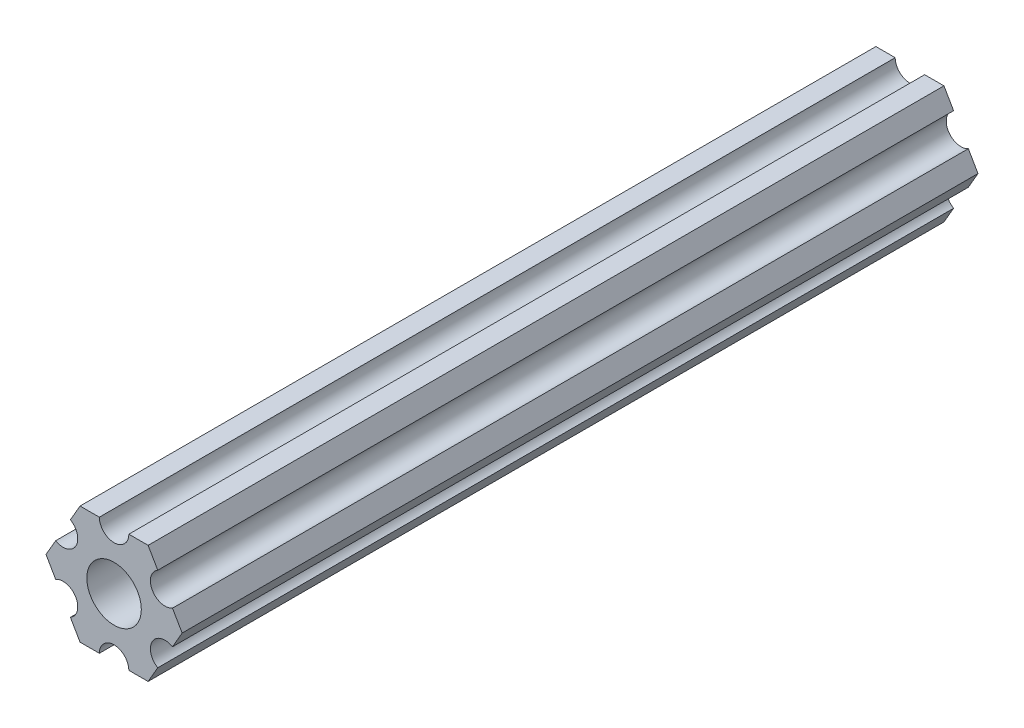
ISO-10303-21;
HEADER;
FILE_DESCRIPTION(('STEP AP214'),'2;1');
FILE_NAME('part.step','',(''),(''),'','','');
FILE_SCHEMA(('AUTOMOTIVE_DESIGN { 1 0 10303 214 1 1 1 1 }'));
ENDSEC;
DATA;
#1=APPLICATION_CONTEXT('core data for automotive mechanical design processes');
#2=APPLICATION_PROTOCOL_DEFINITION('international standard','automotive_design',2000,#1);
#3=PRODUCT_CONTEXT('',#1,'mechanical');
#4=PRODUCT('Part','Part','',(#3));
#5=PRODUCT_RELATED_PRODUCT_CATEGORY('part','',(#4));
#6=PRODUCT_DEFINITION_FORMATION('','',#4);
#7=PRODUCT_DEFINITION_CONTEXT('part definition',#1,'design');
#8=PRODUCT_DEFINITION('design','',#6,#7);
#9=PRODUCT_DEFINITION_SHAPE('','',#8);
#10=(LENGTH_UNIT() NAMED_UNIT(*) SI_UNIT(.MILLI.,.METRE.));
#11=(NAMED_UNIT(*) PLANE_ANGLE_UNIT() SI_UNIT($,.RADIAN.));
#12=(NAMED_UNIT(*) SI_UNIT($,.STERADIAN.) SOLID_ANGLE_UNIT());
#13=UNCERTAINTY_MEASURE_WITH_UNIT(LENGTH_MEASURE(1.E-05),#10,'distance_accuracy_value','');
#14=(GEOMETRIC_REPRESENTATION_CONTEXT(3) GLOBAL_UNCERTAINTY_ASSIGNED_CONTEXT((#13)) GLOBAL_UNIT_ASSIGNED_CONTEXT((#10,
#11,#12)) REPRESENTATION_CONTEXT('',''));
#15=CARTESIAN_POINT('',(0.,0.,0.));
#16=DIRECTION('',(0.,0.,1.));
#17=DIRECTION('',(1.,0.,0.));
#18=AXIS2_PLACEMENT_3D('',#15,#16,#17);
#19=CARTESIAN_POINT('',(5.49926150638083,-3.17499966684068,85.725));
#20=DIRECTION('',(0.,0.,-1.));
#21=DIRECTION('',(-1.,0.,0.));
#22=AXIS2_PLACEMENT_3D('',#19,#20,#21);
#23=CYLINDRICAL_SURFACE('',#22,1.58750000000001);
#24=CARTESIAN_POINT('',(5.49926150638083,-3.17499966684068,0.));
#25=DIRECTION('',(0.,0.,1.));
#26=DIRECTION('',(1.,0.,0.));
#27=AXIS2_PLACEMENT_3D('',#24,#25,#26);
#28=CIRCLE('',#27,1.58750000000001);
#29=CARTESIAN_POINT('',(6.29301142309098,-1.80018429024546,0.));
#30=VERTEX_POINT('',#29);
#31=CARTESIAN_POINT('',(4.70551158967068,-4.54981504343589,0.));
#32=VERTEX_POINT('',#31);
#33=EDGE_CURVE('E189',#30,#32,#28,.T.);
#34=ORIENTED_EDGE('',*,*,#33,.F.);
#35=DIRECTION('',(0.,0.,-1.));
#36=VECTOR('',#35,1.);
#37=CARTESIAN_POINT('',(6.29301142309098,-1.80018429024546,85.725));
#38=LINE('',#37,#36);
#39=CARTESIAN_POINT('',(6.29301142309098,-1.80018429024546,85.725));
#40=VERTEX_POINT('',#39);
#41=EDGE_CURVE('E11',#40,#30,#38,.T.);
#42=ORIENTED_EDGE('',*,*,#41,.F.);
#43=CARTESIAN_POINT('',(5.49926150638083,-3.17499966684068,85.725));
#44=DIRECTION('',(0.,0.,1.));
#45=DIRECTION('',(1.,0.,0.));
#46=AXIS2_PLACEMENT_3D('',#43,#44,#45);
#47=CIRCLE('',#46,1.58750000000001);
#48=CARTESIAN_POINT('',(4.70551158967068,-4.54981504343589,85.725));
#49=VERTEX_POINT('',#48);
#50=EDGE_CURVE('E240',#40,#49,#47,.T.);
#51=ORIENTED_EDGE('',*,*,#50,.T.);
#52=DIRECTION('',(0.,0.,-1.));
#53=VECTOR('',#52,1.);
#54=CARTESIAN_POINT('',(4.70551158967068,-4.54981504343589,85.725));
#55=LINE('',#54,#53);
#56=EDGE_CURVE('E35',#49,#32,#55,.T.);
#57=ORIENTED_EDGE('',*,*,#56,.T.);
#58=EDGE_LOOP('',(#34,#42,#51,#57));
#59=FACE_BOUND('',#58,.T.);
#60=ADVANCED_FACE('F32',(#59),#23,.F.);
#61=CARTESIAN_POINT('',(7.33234841870826,4.44212518961143E-07,85.725));
#62=DIRECTION('',(0.866025434075723,-0.499999947533953,0.));
#63=DIRECTION('',(0.499999947533953,0.866025434075723,0.));
#64=AXIS2_PLACEMENT_3D('',#61,#62,#63);
#65=PLANE('',#64);
#66=DIRECTION('',(-0.499999947533953,-0.866025434075723,0.));
#67=VECTOR('',#66,1.);
#68=CARTESIAN_POINT('',(7.33234841870826,4.44212518961143E-07,0.));
#69=LINE('',#68,#67);
#70=CARTESIAN_POINT('',(7.33234841870826,4.44212518961143E-07,0.));
#71=VERTEX_POINT('',#70);
#72=EDGE_CURVE('E238',#71,#30,#69,.T.);
#73=ORIENTED_EDGE('',*,*,#72,.F.);
#74=DIRECTION('',(0.,0.,-1.));
#75=VECTOR('',#74,1.);
#76=CARTESIAN_POINT('',(7.33234841870826,4.44212518961143E-07,85.725));
#77=LINE('',#76,#75);
#78=CARTESIAN_POINT('',(7.33234841870826,4.44212518961143E-07,85.725));
#79=VERTEX_POINT('',#78);
#80=EDGE_CURVE('E41',#79,#71,#77,.T.);
#81=ORIENTED_EDGE('',*,*,#80,.F.);
#82=DIRECTION('',(-0.499999947533953,-0.866025434075723,0.));
#83=VECTOR('',#82,1.);
#84=CARTESIAN_POINT('',(7.33234841870826,4.44212518961143E-07,85.725));
#85=LINE('',#84,#83);
#86=EDGE_CURVE('E179',#79,#40,#85,.T.);
#87=ORIENTED_EDGE('',*,*,#86,.T.);
#88=ORIENTED_EDGE('',*,*,#41,.T.);
#89=EDGE_LOOP('',(#73,#81,#87,#88));
#90=FACE_BOUND('',#89,.T.);
#91=ADVANCED_FACE('F272',(#90),#65,.T.);
#92=CARTESIAN_POINT('',(6.29301120497139,1.80018505273895,85.725));
#93=DIRECTION('',(0.866025373493145,0.500000052466056,0.));
#94=DIRECTION('',(-0.500000052466056,0.866025373493145,0.));
#95=AXIS2_PLACEMENT_3D('',#92,#93,#94);
#96=PLANE('',#95);
#97=DIRECTION('',(0.500000052466056,-0.866025373493145,0.));
#98=VECTOR('',#97,1.);
#99=CARTESIAN_POINT('',(6.29301120497139,1.80018505273895,0.));
#100=LINE('',#99,#98);
#101=CARTESIAN_POINT('',(6.29301120497139,1.80018505273895,0.));
#102=VERTEX_POINT('',#101);
#103=EDGE_CURVE('E166',#102,#71,#100,.T.);
#104=ORIENTED_EDGE('',*,*,#103,.F.);
#105=DIRECTION('',(0.,0.,-1.));
#106=VECTOR('',#105,1.);
#107=CARTESIAN_POINT('',(6.29301120497139,1.80018505273895,85.725));
#108=LINE('',#107,#106);
#109=CARTESIAN_POINT('',(6.29301120497139,1.80018505273895,85.725));
#110=VERTEX_POINT('',#109);
#111=EDGE_CURVE('E161',#110,#102,#108,.T.);
#112=ORIENTED_EDGE('',*,*,#111,.F.);
#113=DIRECTION('',(0.500000052466056,-0.866025373493145,0.));
#114=VECTOR('',#113,1.);
#115=CARTESIAN_POINT('',(6.29301120497139,1.80018505273895,85.725));
#116=LINE('',#115,#114);
#117=EDGE_CURVE('E164',#110,#79,#116,.T.);
#118=ORIENTED_EDGE('',*,*,#117,.T.);
#119=ORIENTED_EDGE('',*,*,#80,.T.);
#120=EDGE_LOOP('',(#104,#112,#118,#119));
#121=FACE_BOUND('',#120,.T.);
#122=ADVANCED_FACE('F163',(#121),#96,.T.);
#123=CARTESIAN_POINT('',(5.49926112168153,3.17500033315932,85.725));
#124=DIRECTION('',(0.,0.,-1.));
#125=DIRECTION('',(-1.,0.,0.));
#126=AXIS2_PLACEMENT_3D('',#123,#124,#125);
#127=CYLINDRICAL_SURFACE('',#126,1.5875);
#128=CARTESIAN_POINT('',(5.49926112168153,3.17500033315932,0.));
#129=DIRECTION('',(0.,0.,1.));
#130=DIRECTION('',(1.,0.,0.));
#131=AXIS2_PLACEMENT_3D('',#128,#129,#130);
#132=CIRCLE('',#131,1.5875);
#133=CARTESIAN_POINT('',(4.70551103839166,4.54981561357968,0.));
#134=VERTEX_POINT('',#133);
#135=EDGE_CURVE('E235',#134,#102,#132,.T.);
#136=ORIENTED_EDGE('',*,*,#135,.F.);
#137=DIRECTION('',(0.,0.,-1.));
#138=VECTOR('',#137,1.);
#139=CARTESIAN_POINT('',(4.70551103839166,4.54981561357968,85.725));
#140=LINE('',#139,#138);
#141=CARTESIAN_POINT('',(4.70551103839166,4.54981561357968,85.725));
#142=VERTEX_POINT('',#141);
#143=EDGE_CURVE('E171',#142,#134,#140,.T.);
#144=ORIENTED_EDGE('',*,*,#143,.F.);
#145=CARTESIAN_POINT('',(5.49926112168153,3.17500033315932,85.725));
#146=DIRECTION('',(0.,0.,1.));
#147=DIRECTION('',(1.,0.,0.));
#148=AXIS2_PLACEMENT_3D('',#145,#146,#147);
#149=CIRCLE('',#148,1.5875);
#150=EDGE_CURVE('E177',#142,#110,#149,.T.);
#151=ORIENTED_EDGE('',*,*,#150,.T.);
#152=ORIENTED_EDGE('',*,*,#111,.T.);
#153=EDGE_LOOP('',(#136,#144,#151,#152));
#154=FACE_BOUND('',#153,.T.);
#155=ADVANCED_FACE('F181',(#154),#127,.F.);
#156=CARTESIAN_POINT('',(3.66617382465472,6.35000022210622,85.725));
#157=DIRECTION('',(0.866025373493145,0.500000052466056,0.));
#158=DIRECTION('',(-0.500000052466056,0.866025373493145,0.));
#159=AXIS2_PLACEMENT_3D('',#156,#157,#158);
#160=PLANE('',#159);
#161=DIRECTION('',(0.500000052466056,-0.866025373493145,0.));
#162=VECTOR('',#161,1.);
#163=CARTESIAN_POINT('',(3.66617382465472,6.35000022210622,0.));
#164=LINE('',#163,#162);
#165=CARTESIAN_POINT('',(3.66617382465472,6.35000022210622,0.));
#166=VERTEX_POINT('',#165);
#167=EDGE_CURVE('E232',#166,#134,#164,.T.);
#168=ORIENTED_EDGE('',*,*,#167,.F.);
#169=DIRECTION('',(0.,0.,-1.));
#170=VECTOR('',#169,1.);
#171=CARTESIAN_POINT('',(3.66617382465472,6.35000022210622,85.725));
#172=LINE('',#171,#170);
#173=CARTESIAN_POINT('',(3.66617382465472,6.35000022210622,85.725));
#174=VERTEX_POINT('',#173);
#175=EDGE_CURVE('E244',#174,#166,#172,.T.);
#176=ORIENTED_EDGE('',*,*,#175,.F.);
#177=DIRECTION('',(0.500000052466056,-0.866025373493145,0.));
#178=VECTOR('',#177,1.);
#179=CARTESIAN_POINT('',(3.66617382465472,6.35000022210622,85.725));
#180=LINE('',#179,#178);
#181=EDGE_CURVE('E182',#174,#142,#180,.T.);
#182=ORIENTED_EDGE('',*,*,#181,.T.);
#183=ORIENTED_EDGE('',*,*,#143,.T.);
#184=EDGE_LOOP('',(#168,#176,#182,#183));
#185=FACE_BOUND('',#184,.T.);
#186=ADVANCED_FACE('F285',(#185),#160,.T.);
#187=CARTESIAN_POINT('',(1.58749961530066,6.35000022210622,85.725));
#188=DIRECTION('',(0.,1.,0.));
#189=DIRECTION('',(0.,0.,1.));
#190=AXIS2_PLACEMENT_3D('',#187,#188,#189);
#191=PLANE('',#190);
#192=DIRECTION('',(1.,0.,0.));
#193=VECTOR('',#192,1.);
#194=CARTESIAN_POINT('',(1.58749961530066,6.35000022210622,0.));
#195=LINE('',#194,#193);
#196=CARTESIAN_POINT('',(1.58749961530066,6.35000022210622,0.));
#197=VERTEX_POINT('',#196);
#198=EDGE_CURVE('E229',#197,#166,#195,.T.);
#199=ORIENTED_EDGE('',*,*,#198,.F.);
#200=DIRECTION('',(0.,0.,-1.));
#201=VECTOR('',#200,1.);
#202=CARTESIAN_POINT('',(1.58749961530066,6.35000022210622,85.725));
#203=LINE('',#202,#201);
#204=CARTESIAN_POINT('',(1.58749961530066,6.35000022210622,85.725));
#205=VERTEX_POINT('',#204);
#206=EDGE_CURVE('E246',#205,#197,#203,.T.);
#207=ORIENTED_EDGE('',*,*,#206,.F.);
#208=DIRECTION('',(1.,0.,0.));
#209=VECTOR('',#208,1.);
#210=CARTESIAN_POINT('',(1.58749961530066,6.35000022210622,85.725));
#211=LINE('',#210,#209);
#212=EDGE_CURVE('E184',#205,#174,#211,.T.);
#213=ORIENTED_EDGE('',*,*,#212,.T.);
#214=ORIENTED_EDGE('',*,*,#175,.T.);
#215=EDGE_LOOP('',(#199,#207,#213,#214));
#216=FACE_BOUND('',#215,.T.);
#217=ADVANCED_FACE('F288',(#216),#191,.T.);
#218=CARTESIAN_POINT('',(-3.84699344189937E-07,6.35000022210623,85.725));
#219=DIRECTION('',(0.,0.,-1.));
#220=DIRECTION('',(-1.,0.,0.));
#221=AXIS2_PLACEMENT_3D('',#218,#219,#220);
#222=CYLINDRICAL_SURFACE('',#221,1.5875);
#223=CARTESIAN_POINT('',(-3.84699344189937E-07,6.35000022210623,0.));
#224=DIRECTION('',(0.,0.,1.));
#225=DIRECTION('',(1.,0.,0.));
#226=AXIS2_PLACEMENT_3D('',#223,#224,#225);
#227=CIRCLE('',#226,1.5875);
#228=CARTESIAN_POINT('',(-1.58750038469935,6.35000022210622,0.));
#229=VERTEX_POINT('',#228);
#230=EDGE_CURVE('E226',#229,#197,#227,.T.);
#231=ORIENTED_EDGE('',*,*,#230,.F.);
#232=DIRECTION('',(0.,0.,-1.));
#233=VECTOR('',#232,1.);
#234=CARTESIAN_POINT('',(-1.58750038469935,6.35000022210622,85.725));
#235=LINE('',#234,#233);
#236=CARTESIAN_POINT('',(-1.58750038469935,6.35000022210622,85.725));
#237=VERTEX_POINT('',#236);
#238=EDGE_CURVE('E248',#237,#229,#235,.T.);
#239=ORIENTED_EDGE('',*,*,#238,.F.);
#240=CARTESIAN_POINT('',(-3.84699344189937E-07,6.35000022210623,85.725));
#241=DIRECTION('',(0.,0.,1.));
#242=DIRECTION('',(1.,0.,0.));
#243=AXIS2_PLACEMENT_3D('',#240,#241,#242);
#244=CIRCLE('',#243,1.5875);
#245=EDGE_CURVE('E393',#237,#205,#244,.T.);
#246=ORIENTED_EDGE('',*,*,#245,.T.);
#247=ORIENTED_EDGE('',*,*,#206,.T.);
#248=EDGE_LOOP('',(#231,#239,#246,#247));
#249=FACE_BOUND('',#248,.T.);
#250=ADVANCED_FACE('F292',(#249),#222,.F.);
#251=CARTESIAN_POINT('',(-3.66617454558253,6.35000022210623,85.725));
#252=DIRECTION('',(0.,1.,0.));
#253=DIRECTION('',(-1.,0.,0.));
#254=AXIS2_PLACEMENT_3D('',#251,#252,#253);
#255=PLANE('',#254);
#256=DIRECTION('',(1.,0.,0.));
#257=VECTOR('',#256,1.);
#258=CARTESIAN_POINT('',(-3.66617454558253,6.35000022210623,0.));
#259=LINE('',#258,#257);
#260=CARTESIAN_POINT('',(-3.66617454558253,6.35000022210623,0.));
#261=VERTEX_POINT('',#260);
#262=EDGE_CURVE('E223',#261,#229,#259,.T.);
#263=ORIENTED_EDGE('',*,*,#262,.F.);
#264=DIRECTION('',(0.,0.,-1.));
#265=VECTOR('',#264,1.);
#266=CARTESIAN_POINT('',(-3.66617454558253,6.35000022210623,85.725));
#267=LINE('',#266,#265);
#268=CARTESIAN_POINT('',(-3.66617454558253,6.35000022210623,85.725));
#269=VERTEX_POINT('',#268);
#270=EDGE_CURVE('E250',#269,#261,#267,.T.);
#271=ORIENTED_EDGE('',*,*,#270,.F.);
#272=DIRECTION('',(1.,0.,0.));
#273=VECTOR('',#272,1.);
#274=CARTESIAN_POINT('',(-3.66617454558253,6.35000022210623,85.725));
#275=LINE('',#274,#273);
#276=EDGE_CURVE('E390',#269,#237,#275,.T.);
#277=ORIENTED_EDGE('',*,*,#276,.T.);
#278=ORIENTED_EDGE('',*,*,#238,.T.);
#279=EDGE_LOOP('',(#263,#271,#277,#278));
#280=FACE_BOUND('',#279,.T.);
#281=ADVANCED_FACE('F296',(#280),#255,.T.);
#282=CARTESIAN_POINT('',(-4.70551145677116,4.5498155228298,85.725));
#283=DIRECTION('',(-0.866025447431972,0.499999924400248,0.));
#284=DIRECTION('',(-0.499999924400248,-0.866025447431972,0.));
#285=AXIS2_PLACEMENT_3D('',#282,#283,#284);
#286=PLANE('',#285);
#287=DIRECTION('',(0.499999924400248,0.866025447431972,0.));
#288=VECTOR('',#287,1.);
#289=CARTESIAN_POINT('',(-4.70551145677116,4.5498155228298,0.));
#290=LINE('',#289,#288);
#291=CARTESIAN_POINT('',(-4.70551145677116,4.5498155228298,0.));
#292=VERTEX_POINT('',#291);
#293=EDGE_CURVE('E220',#292,#261,#290,.T.);
#294=ORIENTED_EDGE('',*,*,#293,.F.);
#295=DIRECTION('',(0.,0.,-1.));
#296=VECTOR('',#295,1.);
#297=CARTESIAN_POINT('',(-4.70551145677116,4.5498155228298,85.725));
#298=LINE('',#297,#296);
#299=CARTESIAN_POINT('',(-4.70551145677116,4.5498155228298,85.725));
#300=VERTEX_POINT('',#299);
#301=EDGE_CURVE('E252',#300,#292,#298,.T.);
#302=ORIENTED_EDGE('',*,*,#301,.F.);
#303=DIRECTION('',(0.499999924400248,0.866025447431972,0.));
#304=VECTOR('',#303,1.);
#305=CARTESIAN_POINT('',(-4.70551145677116,4.5498155228298,85.725));
#306=LINE('',#305,#304);
#307=EDGE_CURVE('E387',#300,#269,#306,.T.);
#308=ORIENTED_EDGE('',*,*,#307,.T.);
#309=ORIENTED_EDGE('',*,*,#270,.T.);
#310=EDGE_LOOP('',(#294,#302,#308,#309));
#311=FACE_BOUND('',#310,.T.);
#312=ADVANCED_FACE('F300',(#311),#286,.T.);
#313=CARTESIAN_POINT('',(-5.49926133675655,3.17500012503154,85.725));
#314=DIRECTION('',(0.,0.,-1.));
#315=DIRECTION('',(-1.,0.,0.));
#316=AXIS2_PLACEMENT_3D('',#313,#314,#315);
#317=CYLINDRICAL_SURFACE('',#316,1.5875);
#318=CARTESIAN_POINT('',(-5.49926133675655,3.17500012503154,0.));
#319=DIRECTION('',(0.,0.,1.));
#320=DIRECTION('',(1.,0.,0.));
#321=AXIS2_PLACEMENT_3D('',#318,#319,#320);
#322=CIRCLE('',#321,1.5875);
#323=CARTESIAN_POINT('',(-6.29301121674195,1.80018472723328,0.));
#324=VERTEX_POINT('',#323);
#325=EDGE_CURVE('E217',#324,#292,#322,.T.);
#326=ORIENTED_EDGE('',*,*,#325,.F.);
#327=DIRECTION('',(0.,0.,-1.));
#328=VECTOR('',#327,1.);
#329=CARTESIAN_POINT('',(-6.29301121674195,1.80018472723328,85.725));
#330=LINE('',#329,#328);
#331=CARTESIAN_POINT('',(-6.29301121674195,1.80018472723328,85.725));
#332=VERTEX_POINT('',#331);
#333=EDGE_CURVE('E254',#332,#324,#330,.T.);
#334=ORIENTED_EDGE('',*,*,#333,.F.);
#335=CARTESIAN_POINT('',(-5.49926133675655,3.17500012503154,85.725));
#336=DIRECTION('',(0.,0.,1.));
#337=DIRECTION('',(1.,0.,0.));
#338=AXIS2_PLACEMENT_3D('',#335,#336,#337);
#339=CIRCLE('',#338,1.5875);
#340=EDGE_CURVE('E384',#332,#300,#339,.T.);
#341=ORIENTED_EDGE('',*,*,#340,.T.);
#342=ORIENTED_EDGE('',*,*,#301,.T.);
#343=EDGE_LOOP('',(#326,#334,#341,#342));
#344=FACE_BOUND('',#343,.T.);
#345=ADVANCED_FACE('F304',(#344),#317,.F.);
#346=CARTESIAN_POINT('',(-7.33234807945963,1.11911014219708E-07,85.725));
#347=DIRECTION('',(-0.866025447431972,0.499999924400247,0.));
#348=DIRECTION('',(-0.499999924400247,-0.866025447431972,0.));
#349=AXIS2_PLACEMENT_3D('',#346,#347,#348);
#350=PLANE('',#349);
#351=DIRECTION('',(0.499999924400247,0.866025447431972,0.));
#352=VECTOR('',#351,1.);
#353=CARTESIAN_POINT('',(-7.33234807945963,1.11911014219708E-07,0.));
#354=LINE('',#353,#352);
#355=CARTESIAN_POINT('',(-7.33234807945963,1.11911014219708E-07,0.));
#356=VERTEX_POINT('',#355);
#357=EDGE_CURVE('E214',#356,#324,#354,.T.);
#358=ORIENTED_EDGE('',*,*,#357,.F.);
#359=DIRECTION('',(0.,0.,-1.));
#360=VECTOR('',#359,1.);
#361=CARTESIAN_POINT('',(-7.33234807945963,1.11911014219708E-07,85.725));
#362=LINE('',#361,#360);
#363=CARTESIAN_POINT('',(-7.33234807945963,1.11911014219708E-07,85.725));
#364=VERTEX_POINT('',#363);
#365=EDGE_CURVE('E256',#364,#356,#362,.T.);
#366=ORIENTED_EDGE('',*,*,#365,.F.);
#367=DIRECTION('',(0.499999924400247,0.866025447431972,0.));
#368=VECTOR('',#367,1.);
#369=CARTESIAN_POINT('',(-7.33234807945963,1.11911014219708E-07,85.725));
#370=LINE('',#369,#368);
#371=EDGE_CURVE('E381',#364,#332,#370,.T.);
#372=ORIENTED_EDGE('',*,*,#371,.T.);
#373=ORIENTED_EDGE('',*,*,#333,.T.);
#374=EDGE_LOOP('',(#358,#366,#372,#373));
#375=FACE_BOUND('',#374,.T.);
#376=ADVANCED_FACE('F308',(#375),#350,.T.);
#377=CARTESIAN_POINT('',(-6.29301096189761,-1.800184552142,85.725));
#378=DIRECTION('',(-0.866025400205644,-0.500000006198654,0.));
#379=DIRECTION('',(0.500000006198654,-0.866025400205644,0.));
#380=AXIS2_PLACEMENT_3D('',#377,#378,#379);
#381=PLANE('',#380);
#382=DIRECTION('',(-0.500000006198653,0.866025400205644,0.));
#383=VECTOR('',#382,1.);
#384=CARTESIAN_POINT('',(-6.29301096189761,-1.800184552142,0.));
#385=LINE('',#384,#383);
#386=CARTESIAN_POINT('',(-6.29301096189761,-1.800184552142,0.));
#387=VERTEX_POINT('',#386);
#388=EDGE_CURVE('E211',#387,#356,#385,.T.);
#389=ORIENTED_EDGE('',*,*,#388,.F.);
#390=DIRECTION('',(0.,0.,-1.));
#391=VECTOR('',#390,1.);
#392=CARTESIAN_POINT('',(-6.29301096189761,-1.800184552142,85.725));
#393=LINE('',#392,#391);
#394=CARTESIAN_POINT('',(-6.29301096189761,-1.800184552142,85.725));
#395=VERTEX_POINT('',#394);
#396=EDGE_CURVE('E258',#395,#387,#393,.T.);
#397=ORIENTED_EDGE('',*,*,#396,.F.);
#398=DIRECTION('',(-0.500000006198653,0.866025400205644,0.));
#399=VECTOR('',#398,1.);
#400=CARTESIAN_POINT('',(-6.29301096189761,-1.800184552142,85.725));
#401=LINE('',#400,#399);
#402=EDGE_CURVE('E378',#395,#364,#401,.T.);
#403=ORIENTED_EDGE('',*,*,#402,.T.);
#404=ORIENTED_EDGE('',*,*,#365,.T.);
#405=EDGE_LOOP('',(#389,#397,#403,#404));
#406=FACE_BOUND('',#405,.T.);
#407=ADVANCED_FACE('F312',(#406),#381,.T.);
#408=CARTESIAN_POINT('',(-5.49926095205725,-3.17499987496846,85.725));
#409=DIRECTION('',(0.,0.,-1.));
#410=DIRECTION('',(-1.,0.,0.));
#411=AXIS2_PLACEMENT_3D('',#408,#409,#410);
#412=CYLINDRICAL_SURFACE('',#411,1.5875);
#413=CARTESIAN_POINT('',(-5.49926095205725,-3.17499987496846,0.));
#414=DIRECTION('',(0.,0.,1.));
#415=DIRECTION('',(1.,0.,0.));
#416=AXIS2_PLACEMENT_3D('',#413,#414,#415);
#417=CIRCLE('',#416,1.5875);
#418=CARTESIAN_POINT('',(-4.70551094221689,-4.54981519779492,0.));
#419=VERTEX_POINT('',#418);
#420=EDGE_CURVE('E208',#419,#387,#417,.T.);
#421=ORIENTED_EDGE('',*,*,#420,.F.);
#422=DIRECTION('',(0.,0.,-1.));
#423=VECTOR('',#422,1.);
#424=CARTESIAN_POINT('',(-4.70551094221689,-4.54981519779492,85.725));
#425=LINE('',#424,#423);
#426=CARTESIAN_POINT('',(-4.70551094221689,-4.54981519779492,85.725));
#427=VERTEX_POINT('',#426);
#428=EDGE_CURVE('E260',#427,#419,#425,.T.);
#429=ORIENTED_EDGE('',*,*,#428,.F.);
#430=CARTESIAN_POINT('',(-5.49926095205725,-3.17499987496846,85.725));
#431=DIRECTION('',(0.,0.,1.));
#432=DIRECTION('',(1.,0.,0.));
#433=AXIS2_PLACEMENT_3D('',#430,#431,#432);
#434=CIRCLE('',#433,1.5875);
#435=EDGE_CURVE('E375',#427,#395,#434,.T.);
#436=ORIENTED_EDGE('',*,*,#435,.T.);
#437=ORIENTED_EDGE('',*,*,#396,.T.);
#438=EDGE_LOOP('',(#421,#429,#436,#437));
#439=FACE_BOUND('',#438,.T.);
#440=ADVANCED_FACE('F316',(#439),#412,.F.);
#441=CARTESIAN_POINT('',(-3.66617382465481,-6.34999986184805,85.725));
#442=DIRECTION('',(-0.866025400205645,-0.500000006198653,0.));
#443=DIRECTION('',(0.500000006198653,-0.866025400205645,0.));
#444=AXIS2_PLACEMENT_3D('',#441,#442,#443);
#445=PLANE('',#444);
#446=DIRECTION('',(-0.500000006198653,0.866025400205644,0.));
#447=VECTOR('',#446,1.);
#448=CARTESIAN_POINT('',(-3.66617382465481,-6.34999986184805,0.));
#449=LINE('',#448,#447);
#450=CARTESIAN_POINT('',(-3.66617382465481,-6.34999986184805,0.));
#451=VERTEX_POINT('',#450);
#452=EDGE_CURVE('E205',#451,#419,#449,.T.);
#453=ORIENTED_EDGE('',*,*,#452,.F.);
#454=DIRECTION('',(0.,0.,-1.));
#455=VECTOR('',#454,1.);
#456=CARTESIAN_POINT('',(-3.66617382465481,-6.34999986184805,85.725));
#457=LINE('',#456,#455);
#458=CARTESIAN_POINT('',(-3.66617382465481,-6.34999986184805,85.725));
#459=VERTEX_POINT('',#458);
#460=EDGE_CURVE('E262',#459,#451,#457,.T.);
#461=ORIENTED_EDGE('',*,*,#460,.F.);
#462=DIRECTION('',(-0.500000006198653,0.866025400205644,0.));
#463=VECTOR('',#462,1.);
#464=CARTESIAN_POINT('',(-3.66617382465481,-6.34999986184805,85.725));
#465=LINE('',#464,#463);
#466=EDGE_CURVE('E372',#459,#427,#465,.T.);
#467=ORIENTED_EDGE('',*,*,#466,.T.);
#468=ORIENTED_EDGE('',*,*,#428,.T.);
#469=EDGE_LOOP('',(#453,#461,#467,#468));
#470=FACE_BOUND('',#469,.T.);
#471=ADVANCED_FACE('F320',(#470),#445,.T.);
#472=CARTESIAN_POINT('',(-1.58749961530074,-6.34999986184805,85.725));
#473=DIRECTION('',(0.,-1.,0.));
#474=DIRECTION('',(1.,0.,0.));
#475=AXIS2_PLACEMENT_3D('',#472,#473,#474);
#476=PLANE('',#475);
#477=DIRECTION('',(-1.,0.,0.));
#478=VECTOR('',#477,1.);
#479=CARTESIAN_POINT('',(-1.58749961530074,-6.34999986184805,0.));
#480=LINE('',#479,#478);
#481=CARTESIAN_POINT('',(-1.58749961530074,-6.34999986184805,0.));
#482=VERTEX_POINT('',#481);
#483=EDGE_CURVE('E202',#482,#451,#480,.T.);
#484=ORIENTED_EDGE('',*,*,#483,.F.);
#485=DIRECTION('',(0.,0.,-1.));
#486=VECTOR('',#485,1.);
#487=CARTESIAN_POINT('',(-1.58749961530074,-6.34999986184805,85.725));
#488=LINE('',#487,#486);
#489=CARTESIAN_POINT('',(-1.58749961530074,-6.34999986184805,85.725));
#490=VERTEX_POINT('',#489);
#491=EDGE_CURVE('E264',#490,#482,#488,.T.);
#492=ORIENTED_EDGE('',*,*,#491,.F.);
#493=DIRECTION('',(-1.,0.,0.));
#494=VECTOR('',#493,1.);
#495=CARTESIAN_POINT('',(-1.58749961530074,-6.34999986184805,85.725));
#496=LINE('',#495,#494);
#497=EDGE_CURVE('E369',#490,#459,#496,.T.);
#498=ORIENTED_EDGE('',*,*,#497,.T.);
#499=ORIENTED_EDGE('',*,*,#460,.T.);
#500=EDGE_LOOP('',(#484,#492,#498,#499));
#501=FACE_BOUND('',#500,.T.);
#502=ADVANCED_FACE('F324',(#501),#476,.T.);
#503=CARTESIAN_POINT('',(3.8469926204343E-07,-6.34999986184805,85.725));
#504=DIRECTION('',(0.,0.,-1.));
#505=DIRECTION('',(-1.,0.,0.));
#506=AXIS2_PLACEMENT_3D('',#503,#504,#505);
#507=CYLINDRICAL_SURFACE('',#506,1.5875);
#508=CARTESIAN_POINT('',(3.8469926204343E-07,-6.34999986184805,0.));
#509=DIRECTION('',(0.,0.,1.));
#510=DIRECTION('',(1.,0.,0.));
#511=AXIS2_PLACEMENT_3D('',#508,#509,#510);
#512=CIRCLE('',#511,1.5875);
#513=CARTESIAN_POINT('',(1.58750038469926,-6.34999986184804,0.));
#514=VERTEX_POINT('',#513);
#515=EDGE_CURVE('E199',#514,#482,#512,.T.);
#516=ORIENTED_EDGE('',*,*,#515,.F.);
#517=DIRECTION('',(0.,0.,-1.));
#518=VECTOR('',#517,1.);
#519=CARTESIAN_POINT('',(1.58750038469926,-6.34999986184804,85.725));
#520=LINE('',#519,#518);
#521=CARTESIAN_POINT('',(1.58750038469926,-6.34999986184804,85.725));
#522=VERTEX_POINT('',#521);
#523=EDGE_CURVE('E266',#522,#514,#520,.T.);
#524=ORIENTED_EDGE('',*,*,#523,.F.);
#525=CARTESIAN_POINT('',(3.8469926204343E-07,-6.34999986184805,85.725));
#526=DIRECTION('',(0.,0.,1.));
#527=DIRECTION('',(1.,0.,0.));
#528=AXIS2_PLACEMENT_3D('',#525,#526,#527);
#529=CIRCLE('',#528,1.5875);
#530=EDGE_CURVE('E366',#522,#490,#529,.T.);
#531=ORIENTED_EDGE('',*,*,#530,.T.);
#532=ORIENTED_EDGE('',*,*,#491,.T.);
#533=EDGE_LOOP('',(#516,#524,#531,#532));
#534=FACE_BOUND('',#533,.T.);
#535=ADVANCED_FACE('F328',(#534),#507,.F.);
#536=CARTESIAN_POINT('',(3.66617454558244,-6.34999986184805,85.725));
#537=DIRECTION('',(0.,-1.,0.));
#538=DIRECTION('',(1.,0.,0.));
#539=AXIS2_PLACEMENT_3D('',#536,#537,#538);
#540=PLANE('',#539);
#541=DIRECTION('',(-1.,0.,0.));
#542=VECTOR('',#541,1.);
#543=CARTESIAN_POINT('',(3.66617454558244,-6.34999986184805,0.));
#544=LINE('',#543,#542);
#545=CARTESIAN_POINT('',(3.66617454558244,-6.34999986184805,0.));
#546=VERTEX_POINT('',#545);
#547=EDGE_CURVE('E196',#546,#514,#544,.T.);
#548=ORIENTED_EDGE('',*,*,#547,.F.);
#549=DIRECTION('',(0.,0.,-1.));
#550=VECTOR('',#549,1.);
#551=CARTESIAN_POINT('',(3.66617454558244,-6.34999986184805,85.725));
#552=LINE('',#551,#550);
#553=CARTESIAN_POINT('',(3.66617454558244,-6.34999986184805,85.725));
#554=VERTEX_POINT('',#553);
#555=EDGE_CURVE('E267',#554,#546,#552,.T.);
#556=ORIENTED_EDGE('',*,*,#555,.F.);
#557=DIRECTION('',(-1.,0.,0.));
#558=VECTOR('',#557,1.);
#559=CARTESIAN_POINT('',(3.66617454558244,-6.34999986184805,85.725));
#560=LINE('',#559,#558);
#561=EDGE_CURVE('E363',#554,#522,#560,.T.);
#562=ORIENTED_EDGE('',*,*,#561,.T.);
#563=ORIENTED_EDGE('',*,*,#523,.T.);
#564=EDGE_LOOP('',(#548,#556,#562,#563));
#565=FACE_BOUND('',#564,.T.);
#566=ADVANCED_FACE('F332',(#565),#540,.T.);
#567=CARTESIAN_POINT('',(4.70551158967068,-4.54981504343589,85.725));
#568=DIRECTION('',(0.866025434075723,-0.499999947533953,0.));
#569=DIRECTION('',(0.499999947533953,0.866025434075723,0.));
#570=AXIS2_PLACEMENT_3D('',#567,#568,#569);
#571=PLANE('',#570);
#572=DIRECTION('',(-0.499999947533953,-0.866025434075723,0.));
#573=VECTOR('',#572,1.);
#574=CARTESIAN_POINT('',(4.70551158967068,-4.54981504343589,0.));
#575=LINE('',#574,#573);
#576=EDGE_CURVE('E192',#32,#546,#575,.T.);
#577=ORIENTED_EDGE('',*,*,#576,.F.);
#578=ORIENTED_EDGE('',*,*,#56,.F.);
#579=DIRECTION('',(-0.499999947533953,-0.866025434075723,0.));
#580=VECTOR('',#579,1.);
#581=CARTESIAN_POINT('',(4.70551158967068,-4.54981504343589,85.725));
#582=LINE('',#581,#580);
#583=EDGE_CURVE('E361',#49,#554,#582,.T.);
#584=ORIENTED_EDGE('',*,*,#583,.T.);
#585=ORIENTED_EDGE('',*,*,#555,.T.);
#586=EDGE_LOOP('',(#577,#578,#584,#585));
#587=FACE_BOUND('',#586,.T.);
#588=ADVANCED_FACE('F269',(#587),#571,.T.);
#589=CARTESIAN_POINT('',(5.49926150638083,-3.17499966684068,85.725));
#590=DIRECTION('',(0.,0.,1.));
#591=DIRECTION('',(1.,0.,0.));
#592=AXIS2_PLACEMENT_3D('',#589,#590,#591);
#593=PLANE('',#592);
#594=CARTESIAN_POINT('',(0.,0.,85.725));
#595=DIRECTION('',(0.,0.,-1.));
#596=DIRECTION('',(1.,0.,0.));
#597=AXIS2_PLACEMENT_3D('',#594,#595,#596);
#598=CIRCLE('',#597,2.9337);
#599=CARTESIAN_POINT('',(2.9337,0.,85.725));
#600=VERTEX_POINT('',#599);
#601=EDGE_CURVE('E193',#600,#600,#598,.T.);
#602=ORIENTED_EDGE('',*,*,#601,.T.);
#603=EDGE_LOOP('',(#602));
#604=FACE_BOUND('',#603,.T.);
#605=ORIENTED_EDGE('',*,*,#50,.F.);
#606=ORIENTED_EDGE('',*,*,#86,.F.);
#607=ORIENTED_EDGE('',*,*,#117,.F.);
#608=ORIENTED_EDGE('',*,*,#150,.F.);
#609=ORIENTED_EDGE('',*,*,#181,.F.);
#610=ORIENTED_EDGE('',*,*,#212,.F.);
#611=ORIENTED_EDGE('',*,*,#245,.F.);
#612=ORIENTED_EDGE('',*,*,#276,.F.);
#613=ORIENTED_EDGE('',*,*,#307,.F.);
#614=ORIENTED_EDGE('',*,*,#340,.F.);
#615=ORIENTED_EDGE('',*,*,#371,.F.);
#616=ORIENTED_EDGE('',*,*,#402,.F.);
#617=ORIENTED_EDGE('',*,*,#435,.F.);
#618=ORIENTED_EDGE('',*,*,#466,.F.);
#619=ORIENTED_EDGE('',*,*,#497,.F.);
#620=ORIENTED_EDGE('',*,*,#530,.F.);
#621=ORIENTED_EDGE('',*,*,#561,.F.);
#622=ORIENTED_EDGE('',*,*,#583,.F.);
#623=EDGE_LOOP('',(#605,#606,#607,#608,#609,#610,#611,#612,#613,#614,#615,#616,#617,#618,#619,
#620,#621,#622));
#624=FACE_BOUND('',#623,.T.);
#625=ADVANCED_FACE('F175',(#604,#624),#593,.T.);
#626=CARTESIAN_POINT('',(5.49926150638083,-3.17499966684068,0.));
#627=DIRECTION('',(0.,0.,1.));
#628=DIRECTION('',(1.,0.,0.));
#629=AXIS2_PLACEMENT_3D('',#626,#627,#628);
#630=PLANE('',#629);
#631=CARTESIAN_POINT('',(0.,0.,0.));
#632=DIRECTION('',(0.,0.,-1.));
#633=DIRECTION('',(1.,0.,0.));
#634=AXIS2_PLACEMENT_3D('',#631,#632,#633);
#635=CIRCLE('',#634,2.9337);
#636=CARTESIAN_POINT('',(2.9337,0.,0.));
#637=VERTEX_POINT('',#636);
#638=EDGE_CURVE('E356',#637,#637,#635,.T.);
#639=ORIENTED_EDGE('',*,*,#638,.F.);
#640=EDGE_LOOP('',(#639));
#641=FACE_BOUND('',#640,.T.);
#642=ORIENTED_EDGE('',*,*,#33,.T.);
#643=ORIENTED_EDGE('',*,*,#576,.T.);
#644=ORIENTED_EDGE('',*,*,#547,.T.);
#645=ORIENTED_EDGE('',*,*,#515,.T.);
#646=ORIENTED_EDGE('',*,*,#483,.T.);
#647=ORIENTED_EDGE('',*,*,#452,.T.);
#648=ORIENTED_EDGE('',*,*,#420,.T.);
#649=ORIENTED_EDGE('',*,*,#388,.T.);
#650=ORIENTED_EDGE('',*,*,#357,.T.);
#651=ORIENTED_EDGE('',*,*,#325,.T.);
#652=ORIENTED_EDGE('',*,*,#293,.T.);
#653=ORIENTED_EDGE('',*,*,#262,.T.);
#654=ORIENTED_EDGE('',*,*,#230,.T.);
#655=ORIENTED_EDGE('',*,*,#198,.T.);
#656=ORIENTED_EDGE('',*,*,#167,.T.);
#657=ORIENTED_EDGE('',*,*,#135,.T.);
#658=ORIENTED_EDGE('',*,*,#103,.T.);
#659=ORIENTED_EDGE('',*,*,#72,.T.);
#660=EDGE_LOOP('',(#642,#643,#644,#645,#646,#647,#648,#649,#650,#651,#652,#653,#654,#655,#656,
#657,#658,#659));
#661=FACE_BOUND('',#660,.T.);
#662=ADVANCED_FACE('F271',(#641,#661),#630,.F.);
#663=CARTESIAN_POINT('',(0.,0.,85.725));
#664=DIRECTION('',(0.,0.,-1.));
#665=DIRECTION('',(-1.,0.,0.));
#666=AXIS2_PLACEMENT_3D('',#663,#664,#665);
#667=CYLINDRICAL_SURFACE('',#666,2.9337);
#668=ORIENTED_EDGE('',*,*,#601,.F.);
#669=EDGE_LOOP('',(#668));
#670=FACE_BOUND('',#669,.T.);
#671=ORIENTED_EDGE('',*,*,#638,.T.);
#672=EDGE_LOOP('',(#671));
#673=FACE_BOUND('',#672,.T.);
#674=ADVANCED_FACE('F344',(#670,#673),#667,.F.);
#675=CLOSED_SHELL('',(#60,#91,#122,#155,#186,#217,#250,#281,#312,#345,#376,#407,#440,#471,#502,
#535,#566,#588,#625,#662,#674));
#676=MANIFOLD_SOLID_BREP('B2',#675);
#677=ADVANCED_BREP_SHAPE_REPRESENTATION('',(#18,#676),#14);
#678=SHAPE_DEFINITION_REPRESENTATION(#9,#677);
ENDSEC;
END-ISO-10303-21;
